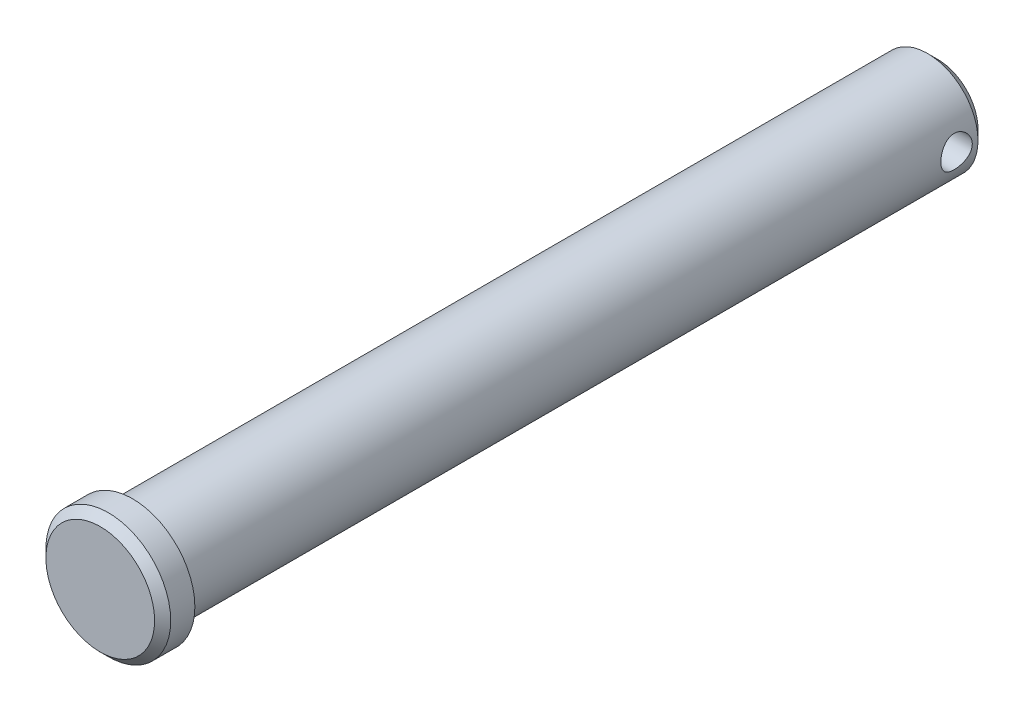
ISO-10303-21;
HEADER;
FILE_DESCRIPTION(('STEP AP214'),'2;1');
FILE_NAME('part.step','',(''),(''),'','','');
FILE_SCHEMA(('AUTOMOTIVE_DESIGN { 1 0 10303 214 1 1 1 1 }'));
ENDSEC;
DATA;
#1=APPLICATION_CONTEXT('core data for automotive mechanical design processes');
#2=APPLICATION_PROTOCOL_DEFINITION('international standard','automotive_design',2000,#1);
#3=PRODUCT_CONTEXT('',#1,'mechanical');
#4=PRODUCT('Part','Part','',(#3));
#5=PRODUCT_RELATED_PRODUCT_CATEGORY('part','',(#4));
#6=PRODUCT_DEFINITION_FORMATION('','',#4);
#7=PRODUCT_DEFINITION_CONTEXT('part definition',#1,'design');
#8=PRODUCT_DEFINITION('design','',#6,#7);
#9=PRODUCT_DEFINITION_SHAPE('','',#8);
#10=(LENGTH_UNIT() NAMED_UNIT(*) SI_UNIT(.MILLI.,.METRE.));
#11=(NAMED_UNIT(*) PLANE_ANGLE_UNIT() SI_UNIT($,.RADIAN.));
#12=(NAMED_UNIT(*) SI_UNIT($,.STERADIAN.) SOLID_ANGLE_UNIT());
#13=UNCERTAINTY_MEASURE_WITH_UNIT(LENGTH_MEASURE(1.E-05),#10,'distance_accuracy_value','');
#14=(GEOMETRIC_REPRESENTATION_CONTEXT(3) GLOBAL_UNCERTAINTY_ASSIGNED_CONTEXT((#13)) GLOBAL_UNIT_ASSIGNED_CONTEXT((#10,
#11,#12)) REPRESENTATION_CONTEXT('',''));
#15=CARTESIAN_POINT('',(0.,0.,0.));
#16=DIRECTION('',(0.,0.,1.));
#17=DIRECTION('',(1.,0.,0.));
#18=AXIS2_PLACEMENT_3D('',#15,#16,#17);
#19=CARTESIAN_POINT('',(0.,6.34999999999999,48.768));
#20=DIRECTION('',(0.,0.,1.));
#21=DIRECTION('',(1.,0.,0.));
#22=AXIS2_PLACEMENT_3D('',#19,#20,#21);
#23=PLANE('',#22);
#24=CARTESIAN_POINT('',(0.,0.,48.768));
#25=DIRECTION('',(0.,0.,1.));
#26=DIRECTION('',(1.,0.,0.));
#27=AXIS2_PLACEMENT_3D('',#24,#25,#26);
#28=CIRCLE('',#27,7.874);
#29=CARTESIAN_POINT('',(7.874,0.,48.768));
#30=VERTEX_POINT('',#29);
#31=EDGE_CURVE('E10',#30,#30,#28,.T.);
#32=ORIENTED_EDGE('',*,*,#31,.F.);
#33=EDGE_LOOP('',(#32));
#34=FACE_BOUND('',#33,.T.);
#35=CARTESIAN_POINT('',(0.,0.,48.768));
#36=DIRECTION('',(0.,0.,1.));
#37=DIRECTION('',(1.,0.,0.));
#38=AXIS2_PLACEMENT_3D('',#35,#36,#37);
#39=CIRCLE('',#38,6.34999999999999);
#40=CARTESIAN_POINT('',(6.34999999999999,0.,48.768));
#41=VERTEX_POINT('',#40);
#42=EDGE_CURVE('E81',#41,#41,#39,.T.);
#43=ORIENTED_EDGE('',*,*,#42,.T.);
#44=EDGE_LOOP('',(#43));
#45=FACE_BOUND('',#44,.T.);
#46=ADVANCED_FACE('F30',(#34,#45),#23,.F.);
#47=CARTESIAN_POINT('',(0.,0.,52.832));
#48=DIRECTION('',(0.,0.,1.));
#49=DIRECTION('',(1.,0.,0.));
#50=AXIS2_PLACEMENT_3D('',#47,#48,#49);
#51=CYLINDRICAL_SURFACE('',#50,7.874);
#52=CARTESIAN_POINT('',(0.,0.,51.816));
#53=DIRECTION('',(0.,0.,1.));
#54=DIRECTION('',(1.,0.,0.));
#55=AXIS2_PLACEMENT_3D('',#52,#53,#54);
#56=CIRCLE('',#55,7.874);
#57=CARTESIAN_POINT('',(7.874,0.,51.816));
#58=VERTEX_POINT('',#57);
#59=EDGE_CURVE('E42',#58,#58,#56,.T.);
#60=ORIENTED_EDGE('',*,*,#59,.F.);
#61=EDGE_LOOP('',(#60));
#62=FACE_BOUND('',#61,.T.);
#63=ORIENTED_EDGE('',*,*,#31,.T.);
#64=EDGE_LOOP('',(#63));
#65=FACE_BOUND('',#64,.T.);
#66=ADVANCED_FACE('F71',(#62,#65),#51,.T.);
#67=CARTESIAN_POINT('',(0.,0.,51.816));
#68=DIRECTION('',(0.,0.,-1.));
#69=DIRECTION('',(-1.,0.,0.));
#70=AXIS2_PLACEMENT_3D('',#67,#68,#69);
#71=CONICAL_SURFACE('',#70,7.874,0.785398163397447);
#72=CARTESIAN_POINT('',(0.,0.,52.832));
#73=DIRECTION('',(0.,0.,1.));
#74=DIRECTION('',(1.,0.,0.));
#75=AXIS2_PLACEMENT_3D('',#72,#73,#74);
#76=CIRCLE('',#75,6.858);
#77=CARTESIAN_POINT('',(6.858,0.,52.832));
#78=VERTEX_POINT('',#77);
#79=EDGE_CURVE('E47',#78,#78,#76,.T.);
#80=ORIENTED_EDGE('',*,*,#79,.F.);
#81=EDGE_LOOP('',(#80));
#82=FACE_BOUND('',#81,.T.);
#83=ORIENTED_EDGE('',*,*,#59,.T.);
#84=EDGE_LOOP('',(#83));
#85=FACE_BOUND('',#84,.T.);
#86=ADVANCED_FACE('F76',(#82,#85),#71,.T.);
#87=CARTESIAN_POINT('',(0.,6.858,52.832));
#88=DIRECTION('',(0.,0.,-1.));
#89=DIRECTION('',(-1.,0.,0.));
#90=AXIS2_PLACEMENT_3D('',#87,#88,#89);
#91=PLANE('',#90);
#92=ORIENTED_EDGE('',*,*,#79,.T.);
#93=EDGE_LOOP('',(#92));
#94=FACE_BOUND('',#93,.T.);
#95=ADVANCED_FACE('F94',(#94),#91,.F.);
#96=CARTESIAN_POINT('',(0.,0.,-52.832));
#97=DIRECTION('',(0.,0.,1.));
#98=DIRECTION('',(1.,0.,0.));
#99=AXIS2_PLACEMENT_3D('',#96,#97,#98);
#100=PLANE('',#99);
#101=CARTESIAN_POINT('',(0.,0.,-52.832));
#102=DIRECTION('',(0.,0.,1.));
#103=DIRECTION('',(1.,0.,0.));
#104=AXIS2_PLACEMENT_3D('',#101,#102,#103);
#105=CIRCLE('',#104,5.07999999999999);
#106=CARTESIAN_POINT('',(5.07999999999999,0.,-52.832));
#107=VERTEX_POINT('',#106);
#108=EDGE_CURVE('E86',#107,#107,#105,.T.);
#109=ORIENTED_EDGE('',*,*,#108,.F.);
#110=EDGE_LOOP('',(#109));
#111=FACE_BOUND('',#110,.T.);
#112=ADVANCED_FACE('F103',(#111),#100,.F.);
#113=CARTESIAN_POINT('',(0.,0.,-52.832));
#114=DIRECTION('',(0.,0.,1.));
#115=DIRECTION('',(1.,0.,0.));
#116=AXIS2_PLACEMENT_3D('',#113,#114,#115);
#117=CONICAL_SURFACE('',#116,5.07999999999999,0.785398163397447);
#118=CARTESIAN_POINT('',(0.,0.,-51.562));
#119=DIRECTION('',(0.,0.,1.));
#120=DIRECTION('',(1.,0.,0.));
#121=AXIS2_PLACEMENT_3D('',#118,#119,#120);
#122=CIRCLE('',#121,6.35);
#123=CARTESIAN_POINT('',(6.35,0.,-51.562));
#124=VERTEX_POINT('',#123);
#125=EDGE_CURVE('E83',#124,#124,#122,.T.);
#126=ORIENTED_EDGE('',*,*,#125,.F.);
#127=EDGE_LOOP('',(#126));
#128=FACE_BOUND('',#127,.T.);
#129=ORIENTED_EDGE('',*,*,#108,.T.);
#130=EDGE_LOOP('',(#129));
#131=FACE_BOUND('',#130,.T.);
#132=ADVANCED_FACE('F66',(#128,#131),#117,.T.);
#133=CARTESIAN_POINT('',(0.,0.,52.832));
#134=DIRECTION('',(0.,0.,1.));
#135=DIRECTION('',(1.,0.,0.));
#136=AXIS2_PLACEMENT_3D('',#133,#134,#135);
#137=CYLINDRICAL_SURFACE('',#136,6.34999999999999);
#138=CARTESIAN_POINT('',(6.34999999999999,0.,-50.841275));
#139=CARTESIAN_POINT('',(6.34999944191376,-0.108482053815229,-50.8412742662155));
#140=CARTESIAN_POINT('',(6.34719381979923,-0.216971770239355,-50.8323356121122));
#141=CARTESIAN_POINT('',(6.33627648078364,-0.430779061996673,-50.7969105266354));
#142=CARTESIAN_POINT('',(6.32816354743825,-0.53609590431181,-50.7704200723432));
#143=CARTESIAN_POINT('',(6.30751797305866,-0.740443365771953,-50.7008712566799));
#144=CARTESIAN_POINT('',(6.29499216266338,-0.839483422702748,-50.6578384916215));
#145=CARTESIAN_POINT('',(6.26681449132438,-1.02894200868958,-50.5565353376716));
#146=CARTESIAN_POINT('',(6.25116214092816,-1.1193591845754,-50.49826256255));
#147=CARTESIAN_POINT('',(6.21785402476642,-1.29179034799153,-50.3662443689761));
#148=CARTESIAN_POINT('',(6.20015471603802,-1.37350150272824,-50.2921144424473));
#149=CARTESIAN_POINT('',(6.16500002189121,-1.52355705933183,-50.1313049575845));
#150=CARTESIAN_POINT('',(6.14754468225747,-1.59189898271285,-50.0446230774511));
#151=CARTESIAN_POINT('',(6.11438731602228,-1.71491620179898,-49.8585510220527));
#152=CARTESIAN_POINT('',(6.09873904628134,-1.7692135359322,-49.7589004785228));
#153=CARTESIAN_POINT('',(6.07162231429105,-1.86015340123054,-49.5513153691471));
#154=CARTESIAN_POINT('',(6.06015275518069,-1.89680056616585,-49.4433829862022));
#155=CARTESIAN_POINT('',(6.04314746427738,-1.95029236843636,-49.2257145633516));
#156=CARTESIAN_POINT('',(6.03744388528544,-1.96769861925333,-49.11613001703));
#157=CARTESIAN_POINT('',(6.03211795151023,-1.98396901153041,-48.8954589979477));
#158=CARTESIAN_POINT('',(6.03249398595089,-1.98283806436661,-48.7843729308038));
#159=CARTESIAN_POINT('',(6.03913661048652,-1.96250549862909,-48.568494686881));
#160=CARTESIAN_POINT('',(6.04517060247605,-1.94401739460317,-48.4636269458569));
#161=CARTESIAN_POINT('',(6.06207146491395,-1.89065202360252,-48.2585630279835));
#162=CARTESIAN_POINT('',(6.07293884748615,-1.85577301990126,-48.1583673474075));
#163=CARTESIAN_POINT('',(6.09846057701418,-1.77011116752195,-47.9637901396348));
#164=CARTESIAN_POINT('',(6.1131678003889,-1.71910397266693,-47.8695146131287));
#165=CARTESIAN_POINT('',(6.14468780418889,-1.60278945947204,-47.6906266395056));
#166=CARTESIAN_POINT('',(6.16150112961326,-1.53747843642393,-47.6060167044425));
#167=CARTESIAN_POINT('',(6.19627243074904,-1.3909072470218,-47.4448273691183));
#168=CARTESIAN_POINT('',(6.2142477308458,-1.3090579269484,-47.3687864466311));
#169=CARTESIAN_POINT('',(6.24864473433523,-1.13354547932791,-47.2313792008928));
#170=CARTESIAN_POINT('',(6.26506632330994,-1.0398814829109,-47.1700139578764));
#171=CARTESIAN_POINT('',(6.29467713227722,-0.842363110753377,-47.0633366900099));
#172=CARTESIAN_POINT('',(6.30784032074609,-0.738435399445834,-47.0181527357604));
#173=CARTESIAN_POINT('',(6.32926329113115,-0.523948186331738,-46.9460684246639));
#174=CARTESIAN_POINT('',(6.33752455689239,-0.413390702571121,-46.9191625345659));
#175=CARTESIAN_POINT('',(6.34797425872442,-0.193353285953618,-46.8853145441885));
#176=CARTESIAN_POINT('',(6.35038433771717,-0.0839958564551768,-46.8776434420254));
#177=CARTESIAN_POINT('',(6.34951541983827,0.134455241936329,-46.8804278596774));
#178=CARTESIAN_POINT('',(6.34623725109121,0.243548946908362,-46.890880740909));
#179=CARTESIAN_POINT('',(6.33450579291727,0.455566407218525,-46.9290309983482));
#180=CARTESIAN_POINT('',(6.32618267316009,0.558576053230561,-46.9562949128561));
#181=CARTESIAN_POINT('',(6.30533468544982,0.758530329266332,-47.0267647031374));
#182=CARTESIAN_POINT('',(6.29280929908845,0.855474209241501,-47.0699725458827));
#183=CARTESIAN_POINT('',(6.26446594711381,1.04316845855611,-47.1722791729148));
#184=CARTESIAN_POINT('',(6.24857528480361,1.13371074325382,-47.2317390205024));
#185=CARTESIAN_POINT('',(6.21531870814298,1.30377700855769,-47.3644283894272));
#186=CARTESIAN_POINT('',(6.19795239559601,1.38329799979673,-47.4376616339542));
#187=CARTESIAN_POINT('',(6.16283879297724,1.53232382846575,-47.5992476070336));
#188=CARTESIAN_POINT('',(6.145103539832,1.6013091238034,-47.6880831964596));
#189=CARTESIAN_POINT('',(6.11197799587687,1.72343932207347,-47.8764551660421));
#190=CARTESIAN_POINT('',(6.09658766672327,1.77658448403407,-47.9759913711788));
#191=CARTESIAN_POINT('',(6.07006550850933,1.86519398798625,-48.1827286571379));
#192=CARTESIAN_POINT('',(6.05891707896058,1.90072742155152,-48.2898978687655));
#193=CARTESIAN_POINT('',(6.04223475204794,1.95311797642365,-48.509117278802));
#194=CARTESIAN_POINT('',(6.03669872710473,1.96998217518361,-48.6211656107961));
#195=CARTESIAN_POINT('',(6.03208922070769,1.98404841957655,-48.8415327723773));
#196=CARTESIAN_POINT('',(6.03273566320141,1.98210254813817,-48.9497920280057));
#197=CARTESIAN_POINT('',(6.03973816078873,1.96065990594656,-49.1643604983329));
#198=CARTESIAN_POINT('',(6.04609395112868,1.9411639490251,-49.2706698032214));
#199=CARTESIAN_POINT('',(6.06360361669002,1.88574411949659,-49.4768022834649));
#200=CARTESIAN_POINT('',(6.07468635401468,1.85006333296052,-49.5766973125942));
#201=CARTESIAN_POINT('',(6.10038320870058,1.76347802520768,-49.7691625677552));
#202=CARTESIAN_POINT('',(6.11499804262719,1.71257041438791,-49.8617313024182));
#203=CARTESIAN_POINT('',(6.14682376027785,1.5946536049717,-50.0408255940829));
#204=CARTESIAN_POINT('',(6.16411368075141,1.52709370854492,-50.1269744881629));
#205=CARTESIAN_POINT('',(6.19897711400449,1.37876003793045,-50.2869883795633));
#206=CARTESIAN_POINT('',(6.21655070140983,1.2979827337641,-50.3608500846825));
#207=CARTESIAN_POINT('',(6.25068675771308,1.1223473087501,-50.4965962998297));
#208=CARTESIAN_POINT('',(6.26719777927838,1.0271167844861,-50.5580133485427));
#209=CARTESIAN_POINT('',(6.29670403212196,0.827167793857516,-50.663885139151));
#210=CARTESIAN_POINT('',(6.30970065578047,0.72245310706847,-50.7083466016057));
#211=CARTESIAN_POINT('',(6.32979841262773,0.515750536263784,-50.7757851970872));
#212=CARTESIAN_POINT('',(6.33730835767022,0.414293993433632,-50.8002732937088));
#213=CARTESIAN_POINT('',(6.3474089256386,0.208560280249513,-50.8330169178991));
#214=CARTESIAN_POINT('',(6.35000053648768,0.104283680616354,-50.8412757053862));
#215=CARTESIAN_POINT('',(6.34999999999999,0.,-50.841275));
#216=B_SPLINE_CURVE_WITH_KNOTS('',3,(#138,#139,#140,#141,#142,#143,#144,#145,#146,#147,#148,
#149,#150,#151,#152,#153,#154,#155,#156,#157,#158,#159,#160,#161,#162,#163,#164,#165,#166,#167,
#168,#169,#170,#171,#172,#173,#174,#175,#176,#177,#178,#179,#180,#181,#182,#183,#184,#185,#186,
#187,#188,#189,#190,#191,#192,#193,#194,#195,#196,#197,#198,#199,#200,#201,#202,#203,#204,#205,
#206,#207,#208,#209,#210,#211,#212,#213,#214,#215),.UNSPECIFIED.,.T.,.F.,(4,2,2,2,2,2,2,2,2,2,2,
2,2,2,2,2,2,2,2,2,2,2,2,2,2,2,2,2,2,2,2,2,2,2,2,2,2,2,4),(0.,0.325062858956953,
0.650200248963252,0.97483655808694,1.29952372814841,1.6332213890866,1.96698085483202,
2.30895873520362,2.65084678573534,2.98246809302846,3.31400153965194,3.63247668609598,
3.95098558474397,4.27413583072103,4.59736987217772,4.93526838767174,5.27319176725858,
5.61373350474317,5.95417210529011,6.28149854460845,6.60877733404483,6.92795123055072,
7.24716451610298,7.57414457407806,7.90121314784145,8.24119754649977,8.58117638520646,
8.91981070158706,9.25831659866651,9.58156293728563,9.90479428711225,10.2233239035372,
10.5419181951968,10.8729420342465,11.2040544247024,11.5459316392745,11.8876732053316,
12.2002185651122,12.5127011386948),.UNSPECIFIED.);
#217=CARTESIAN_POINT('',(6.34999999999999,0.,-50.841275));
#218=VERTEX_POINT('',#217);
#219=EDGE_CURVE('E33',#218,#218,#216,.T.);
#220=ORIENTED_EDGE('',*,*,#219,.T.);
#221=EDGE_LOOP('',(#220));
#222=FACE_BOUND('',#221,.T.);
#223=CARTESIAN_POINT('',(-6.34999999999999,0.,-50.841275));
#224=CARTESIAN_POINT('',(-6.34999944191376,0.108482053815229,-50.8412742662155));
#225=CARTESIAN_POINT('',(-6.34719381979923,0.216971770239355,-50.8323356121122));
#226=CARTESIAN_POINT('',(-6.33627648078364,0.430779061996673,-50.7969105266354));
#227=CARTESIAN_POINT('',(-6.32816354743825,0.53609590431181,-50.7704200723432));
#228=CARTESIAN_POINT('',(-6.30751797305866,0.740443365771953,-50.7008712566799));
#229=CARTESIAN_POINT('',(-6.29499216266338,0.839483422702748,-50.6578384916215));
#230=CARTESIAN_POINT('',(-6.26681449132438,1.02894200868958,-50.5565353376716));
#231=CARTESIAN_POINT('',(-6.25116214092816,1.1193591845754,-50.49826256255));
#232=CARTESIAN_POINT('',(-6.21785402476642,1.29179034799153,-50.3662443689761));
#233=CARTESIAN_POINT('',(-6.20015471603802,1.37350150272824,-50.2921144424473));
#234=CARTESIAN_POINT('',(-6.16500002189121,1.52355705933183,-50.1313049575845));
#235=CARTESIAN_POINT('',(-6.14754468225747,1.59189898271285,-50.0446230774511));
#236=CARTESIAN_POINT('',(-6.11438731602228,1.71491620179898,-49.8585510220527));
#237=CARTESIAN_POINT('',(-6.09873904628134,1.7692135359322,-49.7589004785228));
#238=CARTESIAN_POINT('',(-6.07162231429105,1.86015340123054,-49.5513153691471));
#239=CARTESIAN_POINT('',(-6.06015275518069,1.89680056616585,-49.4433829862022));
#240=CARTESIAN_POINT('',(-6.04314746427738,1.95029236843636,-49.2257145633516));
#241=CARTESIAN_POINT('',(-6.03744388528544,1.96769861925333,-49.11613001703));
#242=CARTESIAN_POINT('',(-6.03211795151023,1.98396901153041,-48.8954589979477));
#243=CARTESIAN_POINT('',(-6.03249398595089,1.98283806436661,-48.7843729308038));
#244=CARTESIAN_POINT('',(-6.03913661048652,1.96250549862909,-48.568494686881));
#245=CARTESIAN_POINT('',(-6.04517060247605,1.94401739460317,-48.4636269458569));
#246=CARTESIAN_POINT('',(-6.06207146491395,1.89065202360252,-48.2585630279835));
#247=CARTESIAN_POINT('',(-6.07293884748615,1.85577301990126,-48.1583673474075));
#248=CARTESIAN_POINT('',(-6.09846057701418,1.77011116752195,-47.9637901396348));
#249=CARTESIAN_POINT('',(-6.1131678003889,1.71910397266693,-47.8695146131287));
#250=CARTESIAN_POINT('',(-6.14468780418889,1.60278945947204,-47.6906266395056));
#251=CARTESIAN_POINT('',(-6.16150112961326,1.53747843642393,-47.6060167044425));
#252=CARTESIAN_POINT('',(-6.19627243074904,1.3909072470218,-47.4448273691183));
#253=CARTESIAN_POINT('',(-6.2142477308458,1.3090579269484,-47.3687864466311));
#254=CARTESIAN_POINT('',(-6.24864473433523,1.13354547932791,-47.2313792008928));
#255=CARTESIAN_POINT('',(-6.26506632330994,1.0398814829109,-47.1700139578764));
#256=CARTESIAN_POINT('',(-6.29467713227722,0.842363110753377,-47.0633366900099));
#257=CARTESIAN_POINT('',(-6.30784032074609,0.738435399445834,-47.0181527357604));
#258=CARTESIAN_POINT('',(-6.32926329113115,0.523948186331738,-46.9460684246639));
#259=CARTESIAN_POINT('',(-6.33752455689239,0.413390702571121,-46.9191625345659));
#260=CARTESIAN_POINT('',(-6.34797425872442,0.193353285953618,-46.8853145441885));
#261=CARTESIAN_POINT('',(-6.35038433771717,0.0839958564551768,-46.8776434420254));
#262=CARTESIAN_POINT('',(-6.34951541983827,-0.134455241936329,-46.8804278596774));
#263=CARTESIAN_POINT('',(-6.34623725109121,-0.243548946908362,-46.890880740909));
#264=CARTESIAN_POINT('',(-6.33450579291727,-0.455566407218525,-46.9290309983482));
#265=CARTESIAN_POINT('',(-6.32618267316009,-0.558576053230561,-46.9562949128561));
#266=CARTESIAN_POINT('',(-6.30533468544982,-0.758530329266332,-47.0267647031374));
#267=CARTESIAN_POINT('',(-6.29280929908845,-0.855474209241501,-47.0699725458827));
#268=CARTESIAN_POINT('',(-6.26446594711381,-1.04316845855611,-47.1722791729148));
#269=CARTESIAN_POINT('',(-6.24857528480361,-1.13371074325382,-47.2317390205024));
#270=CARTESIAN_POINT('',(-6.21531870814298,-1.30377700855769,-47.3644283894272));
#271=CARTESIAN_POINT('',(-6.19795239559601,-1.38329799979673,-47.4376616339542));
#272=CARTESIAN_POINT('',(-6.16283879297724,-1.53232382846575,-47.5992476070336));
#273=CARTESIAN_POINT('',(-6.145103539832,-1.6013091238034,-47.6880831964596));
#274=CARTESIAN_POINT('',(-6.11197799587687,-1.72343932207347,-47.8764551660421));
#275=CARTESIAN_POINT('',(-6.09658766672327,-1.77658448403407,-47.9759913711788));
#276=CARTESIAN_POINT('',(-6.07006550850933,-1.86519398798625,-48.1827286571379));
#277=CARTESIAN_POINT('',(-6.05891707896058,-1.90072742155152,-48.2898978687655));
#278=CARTESIAN_POINT('',(-6.04223475204794,-1.95311797642365,-48.509117278802));
#279=CARTESIAN_POINT('',(-6.03669872710473,-1.96998217518361,-48.6211656107961));
#280=CARTESIAN_POINT('',(-6.03208922070769,-1.98404841957655,-48.8415327723773));
#281=CARTESIAN_POINT('',(-6.03273566320141,-1.98210254813817,-48.9497920280057));
#282=CARTESIAN_POINT('',(-6.03973816078873,-1.96065990594656,-49.1643604983329));
#283=CARTESIAN_POINT('',(-6.04609395112868,-1.9411639490251,-49.2706698032214));
#284=CARTESIAN_POINT('',(-6.06360361669002,-1.88574411949659,-49.4768022834649));
#285=CARTESIAN_POINT('',(-6.07468635401468,-1.85006333296052,-49.5766973125942));
#286=CARTESIAN_POINT('',(-6.10038320870058,-1.76347802520768,-49.7691625677552));
#287=CARTESIAN_POINT('',(-6.11499804262719,-1.71257041438791,-49.8617313024182));
#288=CARTESIAN_POINT('',(-6.14682376027785,-1.5946536049717,-50.0408255940829));
#289=CARTESIAN_POINT('',(-6.16411368075141,-1.52709370854492,-50.1269744881629));
#290=CARTESIAN_POINT('',(-6.19897711400449,-1.37876003793045,-50.2869883795633));
#291=CARTESIAN_POINT('',(-6.21655070140983,-1.2979827337641,-50.3608500846825));
#292=CARTESIAN_POINT('',(-6.25068675771308,-1.1223473087501,-50.4965962998297));
#293=CARTESIAN_POINT('',(-6.26719777927838,-1.0271167844861,-50.5580133485427));
#294=CARTESIAN_POINT('',(-6.29670403212196,-0.827167793857516,-50.663885139151));
#295=CARTESIAN_POINT('',(-6.30970065578047,-0.72245310706847,-50.7083466016057));
#296=CARTESIAN_POINT('',(-6.32979841262773,-0.515750536263784,-50.7757851970872));
#297=CARTESIAN_POINT('',(-6.33730835767022,-0.414293993433632,-50.8002732937088));
#298=CARTESIAN_POINT('',(-6.3474089256386,-0.208560280249513,-50.8330169178991));
#299=CARTESIAN_POINT('',(-6.35000053648768,-0.104283680616354,-50.8412757053862));
#300=CARTESIAN_POINT('',(-6.34999999999999,0.,-50.841275));
#301=B_SPLINE_CURVE_WITH_KNOTS('',3,(#223,#224,#225,#226,#227,#228,#229,#230,#231,#232,#233,
#234,#235,#236,#237,#238,#239,#240,#241,#242,#243,#244,#245,#246,#247,#248,#249,#250,#251,#252,
#253,#254,#255,#256,#257,#258,#259,#260,#261,#262,#263,#264,#265,#266,#267,#268,#269,#270,#271,
#272,#273,#274,#275,#276,#277,#278,#279,#280,#281,#282,#283,#284,#285,#286,#287,#288,#289,#290,
#291,#292,#293,#294,#295,#296,#297,#298,#299,#300),.UNSPECIFIED.,.T.,.F.,(4,2,2,2,2,2,2,2,2,2,2,
2,2,2,2,2,2,2,2,2,2,2,2,2,2,2,2,2,2,2,2,2,2,2,2,2,2,2,4),(0.,0.325062858956953,
0.650200248963252,0.97483655808694,1.29952372814841,1.6332213890866,1.96698085483202,
2.30895873520362,2.65084678573534,2.98246809302846,3.31400153965194,3.63247668609598,
3.95098558474397,4.27413583072103,4.59736987217772,4.93526838767174,5.27319176725858,
5.61373350474317,5.95417210529011,6.28149854460845,6.60877733404483,6.92795123055072,
7.24716451610298,7.57414457407806,7.90121314784145,8.24119754649977,8.58117638520646,
8.91981070158706,9.25831659866651,9.58156293728563,9.90479428711225,10.2233239035372,
10.5419181951968,10.8729420342465,11.2040544247024,11.5459316392745,11.8876732053316,
12.2002185651122,12.5127011386948),.UNSPECIFIED.);
#302=CARTESIAN_POINT('',(-6.34999999999999,0.,-50.841275));
#303=VERTEX_POINT('',#302);
#304=EDGE_CURVE('E50',#303,#303,#301,.T.);
#305=ORIENTED_EDGE('',*,*,#304,.T.);
#306=EDGE_LOOP('',(#305));
#307=FACE_BOUND('',#306,.T.);
#308=ORIENTED_EDGE('',*,*,#42,.F.);
#309=EDGE_LOOP('',(#308));
#310=FACE_BOUND('',#309,.T.);
#311=ORIENTED_EDGE('',*,*,#125,.T.);
#312=EDGE_LOOP('',(#311));
#313=FACE_BOUND('',#312,.T.);
#314=ADVANCED_FACE('F55',(#222,#307,#310,#313),#137,.T.);
#315=CARTESIAN_POINT('',(-7.874,0.,-48.860075));
#316=DIRECTION('',(1.,0.,0.));
#317=DIRECTION('',(0.,0.,-1.));
#318=AXIS2_PLACEMENT_3D('',#315,#316,#317);
#319=CYLINDRICAL_SURFACE('',#318,1.9812);
#320=ORIENTED_EDGE('',*,*,#304,.F.);
#321=EDGE_LOOP('',(#320));
#322=FACE_BOUND('',#321,.T.);
#323=ORIENTED_EDGE('',*,*,#219,.F.);
#324=EDGE_LOOP('',(#323));
#325=FACE_BOUND('',#324,.T.);
#326=ADVANCED_FACE('F58',(#322,#325),#319,.F.);
#327=CLOSED_SHELL('',(#46,#66,#86,#95,#112,#132,#314,#326));
#328=MANIFOLD_SOLID_BREP('B2',#327);
#329=ADVANCED_BREP_SHAPE_REPRESENTATION('',(#18,#328),#14);
#330=SHAPE_DEFINITION_REPRESENTATION(#9,#329);
ENDSEC;
END-ISO-10303-21;
